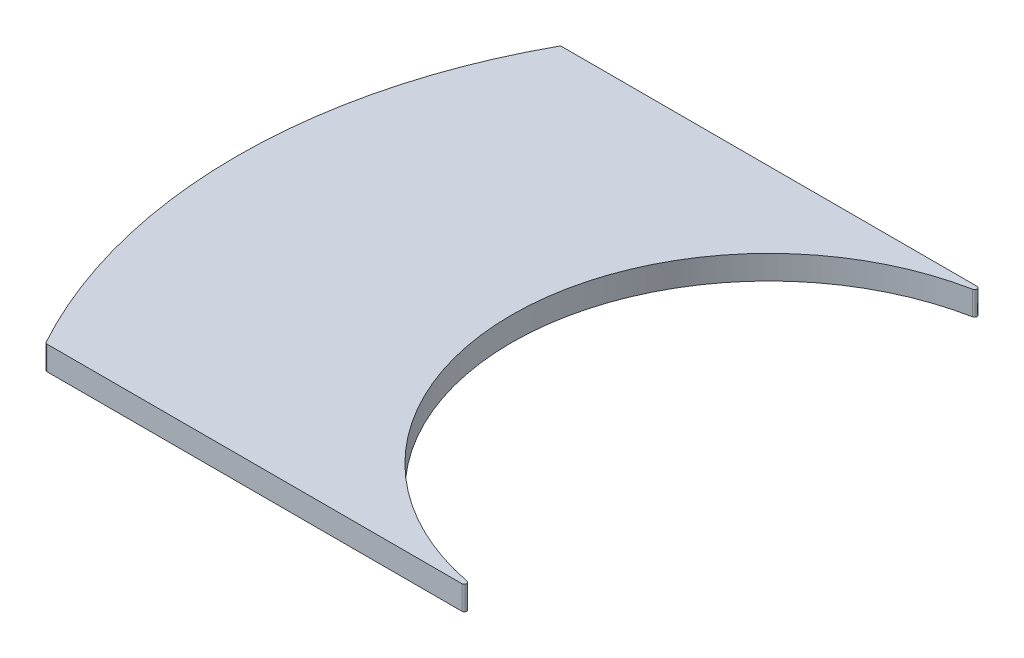
ISO-10303-21;
HEADER;
FILE_DESCRIPTION(('STEP AP214'),'2;1');
FILE_NAME('part.step','',(''),(''),'','','');
FILE_SCHEMA(('AUTOMOTIVE_DESIGN { 1 0 10303 214 1 1 1 1 }'));
ENDSEC;
DATA;
#1=APPLICATION_CONTEXT('core data for automotive mechanical design processes');
#2=APPLICATION_PROTOCOL_DEFINITION('international standard','automotive_design',2000,#1);
#3=PRODUCT_CONTEXT('',#1,'mechanical');
#4=PRODUCT('Part','Part','',(#3));
#5=PRODUCT_RELATED_PRODUCT_CATEGORY('part','',(#4));
#6=PRODUCT_DEFINITION_FORMATION('','',#4);
#7=PRODUCT_DEFINITION_CONTEXT('part definition',#1,'design');
#8=PRODUCT_DEFINITION('design','',#6,#7);
#9=PRODUCT_DEFINITION_SHAPE('','',#8);
#10=(LENGTH_UNIT() NAMED_UNIT(*) SI_UNIT(.MILLI.,.METRE.));
#11=(NAMED_UNIT(*) PLANE_ANGLE_UNIT() SI_UNIT($,.RADIAN.));
#12=(NAMED_UNIT(*) SI_UNIT($,.STERADIAN.) SOLID_ANGLE_UNIT());
#13=UNCERTAINTY_MEASURE_WITH_UNIT(LENGTH_MEASURE(1.E-05),#10,'distance_accuracy_value','');
#14=(GEOMETRIC_REPRESENTATION_CONTEXT(3) GLOBAL_UNCERTAINTY_ASSIGNED_CONTEXT((#13)) GLOBAL_UNIT_ASSIGNED_CONTEXT((#10,
#11,#12)) REPRESENTATION_CONTEXT('',''));
#15=CARTESIAN_POINT('',(0.,0.,0.));
#16=DIRECTION('',(0.,0.,1.));
#17=DIRECTION('',(1.,0.,0.));
#18=AXIS2_PLACEMENT_3D('',#15,#16,#17);
#19=CARTESIAN_POINT('',(0.,1.,-10.76));
#20=DIRECTION('',(0.,0.,1.));
#21=DIRECTION('',(1.,0.,0.));
#22=AXIS2_PLACEMENT_3D('',#19,#20,#21);
#23=PLANE('',#22);
#24=DIRECTION('',(-1.,0.,0.));
#25=VECTOR('',#24,1.);
#26=CARTESIAN_POINT('',(0.,0.,-10.76));
#27=LINE('',#26,#25);
#28=CARTESIAN_POINT('',(-2.07460839678239,0.,-10.76));
#29=VERTEX_POINT('',#28);
#30=CARTESIAN_POINT('',(-19.4104462854413,0.,-10.76));
#31=VERTEX_POINT('',#30);
#32=EDGE_CURVE('E166',#29,#31,#27,.T.);
#33=ORIENTED_EDGE('',*,*,#32,.T.);
#34=DIRECTION('',(0.,-1.,0.));
#35=VECTOR('',#34,1.);
#36=CARTESIAN_POINT('',(-19.4104462854413,1.,-10.76));
#37=LINE('',#36,#35);
#38=CARTESIAN_POINT('',(-19.4104462854413,1.,-10.76));
#39=VERTEX_POINT('',#38);
#40=EDGE_CURVE('E47',#31,#39,#37,.F.);
#41=ORIENTED_EDGE('',*,*,#40,.T.);
#42=DIRECTION('',(-1.,0.,0.));
#43=VECTOR('',#42,1.);
#44=CARTESIAN_POINT('',(0.,1.,-10.76));
#45=LINE('',#44,#43);
#46=CARTESIAN_POINT('',(-2.07460839678239,1.,-10.76));
#47=VERTEX_POINT('',#46);
#48=EDGE_CURVE('E112',#47,#39,#45,.T.);
#49=ORIENTED_EDGE('',*,*,#48,.F.);
#50=DIRECTION('',(0.,1.,0.));
#51=VECTOR('',#50,1.);
#52=CARTESIAN_POINT('',(-2.07460839678239,0.,-10.76));
#53=LINE('',#52,#51);
#54=EDGE_CURVE('E135',#47,#29,#53,.F.);
#55=ORIENTED_EDGE('',*,*,#54,.T.);
#56=EDGE_LOOP('',(#33,#41,#49,#55));
#57=FACE_BOUND('',#56,.T.);
#58=ADVANCED_FACE('F39',(#57),#23,.F.);
#59=CARTESIAN_POINT('',(0.,1.,0.));
#60=DIRECTION('',(0.,-1.,0.));
#61=DIRECTION('',(0.,0.,-1.));
#62=AXIS2_PLACEMENT_3D('',#59,#60,#61);
#63=CYLINDRICAL_SURFACE('',#62,22.245);
#64=CARTESIAN_POINT('',(0.,1.,0.));
#65=DIRECTION('',(0.,1.,0.));
#66=DIRECTION('',(0.,0.,1.));
#67=AXIS2_PLACEMENT_3D('',#64,#65,#66);
#68=CIRCLE('',#67,22.245);
#69=CARTESIAN_POINT('',(-19.4980978830274,1.,-10.7081372770377));
#70=VERTEX_POINT('',#69);
#71=CARTESIAN_POINT('',(-19.4980978830274,1.,10.7081372770377));
#72=VERTEX_POINT('',#71);
#73=EDGE_CURVE('E162',#70,#72,#68,.T.);
#74=ORIENTED_EDGE('',*,*,#73,.F.);
#75=DIRECTION('',(0.,-1.,0.));
#76=VECTOR('',#75,1.);
#77=CARTESIAN_POINT('',(-19.4980978830274,1.,-10.7081372770377));
#78=LINE('',#77,#76);
#79=CARTESIAN_POINT('',(-19.4980978830274,0.,-10.7081372770377));
#80=VERTEX_POINT('',#79);
#81=EDGE_CURVE('E154',#70,#80,#78,.T.);
#82=ORIENTED_EDGE('',*,*,#81,.T.);
#83=CARTESIAN_POINT('',(0.,0.,0.));
#84=DIRECTION('',(0.,1.,0.));
#85=DIRECTION('',(0.,0.,1.));
#86=AXIS2_PLACEMENT_3D('',#83,#84,#85);
#87=CIRCLE('',#86,22.245);
#88=CARTESIAN_POINT('',(-19.4980978830274,0.,10.7081372770377));
#89=VERTEX_POINT('',#88);
#90=EDGE_CURVE('E161',#80,#89,#87,.T.);
#91=ORIENTED_EDGE('',*,*,#90,.T.);
#92=DIRECTION('',(0.,-1.,0.));
#93=VECTOR('',#92,1.);
#94=CARTESIAN_POINT('',(-19.4980978830274,1.,10.7081372770377));
#95=LINE('',#94,#93);
#96=EDGE_CURVE('E149',#89,#72,#95,.F.);
#97=ORIENTED_EDGE('',*,*,#96,.T.);
#98=EDGE_LOOP('',(#74,#82,#91,#97));
#99=FACE_BOUND('',#98,.T.);
#100=ADVANCED_FACE('F160',(#99),#63,.T.);
#101=CARTESIAN_POINT('',(0.,1.,10.76));
#102=DIRECTION('',(0.,0.,1.));
#103=DIRECTION('',(1.,0.,0.));
#104=AXIS2_PLACEMENT_3D('',#101,#102,#103);
#105=PLANE('',#104);
#106=DIRECTION('',(-1.,0.,0.));
#107=VECTOR('',#106,1.);
#108=CARTESIAN_POINT('',(0.,1.,10.76));
#109=LINE('',#108,#107);
#110=CARTESIAN_POINT('',(-2.07460839678239,1.,10.76));
#111=VERTEX_POINT('',#110);
#112=CARTESIAN_POINT('',(-19.4104462854413,1.,10.76));
#113=VERTEX_POINT('',#112);
#114=EDGE_CURVE('E128',#111,#113,#109,.T.);
#115=ORIENTED_EDGE('',*,*,#114,.T.);
#116=DIRECTION('',(0.,1.,0.));
#117=VECTOR('',#116,1.);
#118=CARTESIAN_POINT('',(-19.4104462854413,0.,10.76));
#119=LINE('',#118,#117);
#120=CARTESIAN_POINT('',(-19.4104462854413,0.,10.76));
#121=VERTEX_POINT('',#120);
#122=EDGE_CURVE('E143',#113,#121,#119,.F.);
#123=ORIENTED_EDGE('',*,*,#122,.T.);
#124=DIRECTION('',(-1.,0.,0.));
#125=VECTOR('',#124,1.);
#126=CARTESIAN_POINT('',(0.,0.,10.76));
#127=LINE('',#126,#125);
#128=CARTESIAN_POINT('',(-2.07460839678239,0.,10.76));
#129=VERTEX_POINT('',#128);
#130=EDGE_CURVE('E113',#129,#121,#127,.T.);
#131=ORIENTED_EDGE('',*,*,#130,.F.);
#132=DIRECTION('',(0.,-1.,0.));
#133=VECTOR('',#132,1.);
#134=CARTESIAN_POINT('',(-2.07460839678239,1.,10.76));
#135=LINE('',#134,#133);
#136=EDGE_CURVE('E121',#129,#111,#135,.F.);
#137=ORIENTED_EDGE('',*,*,#136,.T.);
#138=EDGE_LOOP('',(#115,#123,#131,#137));
#139=FACE_BOUND('',#138,.T.);
#140=ADVANCED_FACE('F189',(#139),#105,.T.);
#141=CARTESIAN_POINT('',(0.,1.,0.));
#142=DIRECTION('',(0.,-1.,0.));
#143=DIRECTION('',(0.,0.,-1.));
#144=AXIS2_PLACEMENT_3D('',#141,#142,#143);
#145=CYLINDRICAL_SURFACE('',#144,10.76);
#146=CARTESIAN_POINT('',(0.,0.,0.));
#147=DIRECTION('',(0.,1.,0.));
#148=DIRECTION('',(0.,0.,1.));
#149=AXIS2_PLACEMENT_3D('',#146,#147,#148);
#150=CIRCLE('',#149,10.76);
#151=CARTESIAN_POINT('',(-2.05550518870888,0.,-10.5618416206262));
#152=VERTEX_POINT('',#151);
#153=CARTESIAN_POINT('',(-2.05550518870888,0.,10.5618416206262));
#154=VERTEX_POINT('',#153);
#155=EDGE_CURVE('E102',#152,#154,#150,.T.);
#156=ORIENTED_EDGE('',*,*,#155,.F.);
#157=DIRECTION('',(0.,-1.,0.));
#158=VECTOR('',#157,1.);
#159=CARTESIAN_POINT('',(-2.05550518870888,1.,-10.5618416206262));
#160=LINE('',#159,#158);
#161=CARTESIAN_POINT('',(-2.05550518870888,1.,-10.5618416206262));
#162=VERTEX_POINT('',#161);
#163=EDGE_CURVE('E139',#152,#162,#160,.F.);
#164=ORIENTED_EDGE('',*,*,#163,.T.);
#165=CARTESIAN_POINT('',(0.,1.,0.));
#166=DIRECTION('',(0.,1.,0.));
#167=DIRECTION('',(0.,0.,1.));
#168=AXIS2_PLACEMENT_3D('',#165,#166,#167);
#169=CIRCLE('',#168,10.76);
#170=CARTESIAN_POINT('',(-2.05550518870888,1.,10.5618416206262));
#171=VERTEX_POINT('',#170);
#172=EDGE_CURVE('E125',#162,#171,#169,.T.);
#173=ORIENTED_EDGE('',*,*,#172,.T.);
#174=DIRECTION('',(0.,-1.,0.));
#175=VECTOR('',#174,1.);
#176=CARTESIAN_POINT('',(-2.05550518870888,1.,10.5618416206262));
#177=LINE('',#176,#175);
#178=EDGE_CURVE('E120',#171,#154,#177,.T.);
#179=ORIENTED_EDGE('',*,*,#178,.T.);
#180=EDGE_LOOP('',(#156,#164,#173,#179));
#181=FACE_BOUND('',#180,.T.);
#182=ADVANCED_FACE('F123',(#181),#145,.F.);
#183=CARTESIAN_POINT('',(0.,1.,0.));
#184=DIRECTION('',(0.,1.,0.));
#185=DIRECTION('',(0.,0.,1.));
#186=AXIS2_PLACEMENT_3D('',#183,#184,#185);
#187=PLANE('',#186);
#188=ORIENTED_EDGE('',*,*,#48,.T.);
#189=CARTESIAN_POINT('',(-19.4104462854413,1.,-10.66));
#190=DIRECTION('',(0.,1.,0.));
#191=DIRECTION('',(0.,0.,1.));
#192=AXIS2_PLACEMENT_3D('',#189,#190,#191);
#193=CIRCLE('',#192,0.1);
#194=EDGE_CURVE('E11',#39,#70,#193,.T.);
#195=ORIENTED_EDGE('',*,*,#194,.T.);
#196=ORIENTED_EDGE('',*,*,#73,.T.);
#197=CARTESIAN_POINT('',(-19.4104462854413,1.,10.66));
#198=DIRECTION('',(0.,1.,0.));
#199=DIRECTION('',(0.,0.,1.));
#200=AXIS2_PLACEMENT_3D('',#197,#198,#199);
#201=CIRCLE('',#200,0.1);
#202=EDGE_CURVE('E152',#72,#113,#201,.T.);
#203=ORIENTED_EDGE('',*,*,#202,.T.);
#204=ORIENTED_EDGE('',*,*,#114,.F.);
#205=CARTESIAN_POINT('',(-2.07460839678239,1.,10.66));
#206=DIRECTION('',(0.,1.,0.));
#207=DIRECTION('',(0.,0.,1.));
#208=AXIS2_PLACEMENT_3D('',#205,#206,#207);
#209=CIRCLE('',#208,0.1);
#210=EDGE_CURVE('E133',#111,#171,#209,.T.);
#211=ORIENTED_EDGE('',*,*,#210,.T.);
#212=ORIENTED_EDGE('',*,*,#172,.F.);
#213=CARTESIAN_POINT('',(-2.07460839678239,1.,-10.66));
#214=DIRECTION('',(0.,1.,0.));
#215=DIRECTION('',(0.,0.,1.));
#216=AXIS2_PLACEMENT_3D('',#213,#214,#215);
#217=CIRCLE('',#216,0.1);
#218=EDGE_CURVE('E141',#162,#47,#217,.T.);
#219=ORIENTED_EDGE('',*,*,#218,.T.);
#220=EDGE_LOOP('',(#188,#195,#196,#203,#204,#211,#212,#219));
#221=FACE_BOUND('',#220,.T.);
#222=ADVANCED_FACE('F174',(#221),#187,.T.);
#223=CARTESIAN_POINT('',(0.,0.,0.));
#224=DIRECTION('',(0.,1.,0.));
#225=DIRECTION('',(0.,0.,1.));
#226=AXIS2_PLACEMENT_3D('',#223,#224,#225);
#227=PLANE('',#226);
#228=ORIENTED_EDGE('',*,*,#90,.F.);
#229=CARTESIAN_POINT('',(-19.4104462854413,0.,-10.66));
#230=DIRECTION('',(0.,1.,0.));
#231=DIRECTION('',(0.,0.,1.));
#232=AXIS2_PLACEMENT_3D('',#229,#230,#231);
#233=CIRCLE('',#232,0.1);
#234=EDGE_CURVE('E61',#80,#31,#233,.F.);
#235=ORIENTED_EDGE('',*,*,#234,.T.);
#236=ORIENTED_EDGE('',*,*,#32,.F.);
#237=CARTESIAN_POINT('',(-2.07460839678239,0.,-10.66));
#238=DIRECTION('',(0.,1.,0.));
#239=DIRECTION('',(0.,0.,1.));
#240=AXIS2_PLACEMENT_3D('',#237,#238,#239);
#241=CIRCLE('',#240,0.1);
#242=EDGE_CURVE('E108',#29,#152,#241,.F.);
#243=ORIENTED_EDGE('',*,*,#242,.T.);
#244=ORIENTED_EDGE('',*,*,#155,.T.);
#245=CARTESIAN_POINT('',(-2.07460839678239,0.,10.66));
#246=DIRECTION('',(0.,1.,0.));
#247=DIRECTION('',(0.,0.,1.));
#248=AXIS2_PLACEMENT_3D('',#245,#246,#247);
#249=CIRCLE('',#248,0.1);
#250=EDGE_CURVE('E106',#154,#129,#249,.F.);
#251=ORIENTED_EDGE('',*,*,#250,.T.);
#252=ORIENTED_EDGE('',*,*,#130,.T.);
#253=CARTESIAN_POINT('',(-19.4104462854413,0.,10.66));
#254=DIRECTION('',(0.,1.,0.));
#255=DIRECTION('',(0.,0.,1.));
#256=AXIS2_PLACEMENT_3D('',#253,#254,#255);
#257=CIRCLE('',#256,0.1);
#258=EDGE_CURVE('E146',#121,#89,#257,.F.);
#259=ORIENTED_EDGE('',*,*,#258,.T.);
#260=EDGE_LOOP('',(#228,#235,#236,#243,#244,#251,#252,#259));
#261=FACE_BOUND('',#260,.T.);
#262=ADVANCED_FACE('F104',(#261),#227,.F.);
#263=CARTESIAN_POINT('',(-2.07460839678239,1.,10.66));
#264=DIRECTION('',(0.,-1.,0.));
#265=DIRECTION('',(0.,0.,-1.));
#266=AXIS2_PLACEMENT_3D('',#263,#264,#265);
#267=CYLINDRICAL_SURFACE('',#266,0.1);
#268=ORIENTED_EDGE('',*,*,#210,.F.);
#269=ORIENTED_EDGE('',*,*,#136,.F.);
#270=ORIENTED_EDGE('',*,*,#250,.F.);
#271=ORIENTED_EDGE('',*,*,#178,.F.);
#272=EDGE_LOOP('',(#268,#269,#270,#271));
#273=FACE_BOUND('',#272,.T.);
#274=ADVANCED_FACE('F119',(#273),#267,.T.);
#275=CARTESIAN_POINT('',(-2.07460839678239,1.,-10.66));
#276=DIRECTION('',(0.,-1.,0.));
#277=DIRECTION('',(0.,0.,-1.));
#278=AXIS2_PLACEMENT_3D('',#275,#276,#277);
#279=CYLINDRICAL_SURFACE('',#278,0.1);
#280=ORIENTED_EDGE('',*,*,#218,.F.);
#281=ORIENTED_EDGE('',*,*,#163,.F.);
#282=ORIENTED_EDGE('',*,*,#242,.F.);
#283=ORIENTED_EDGE('',*,*,#54,.F.);
#284=EDGE_LOOP('',(#280,#281,#282,#283));
#285=FACE_BOUND('',#284,.T.);
#286=ADVANCED_FACE('F182',(#285),#279,.T.);
#287=CARTESIAN_POINT('',(-19.4104462854413,1.,10.66));
#288=DIRECTION('',(0.,-1.,0.));
#289=DIRECTION('',(0.,0.,-1.));
#290=AXIS2_PLACEMENT_3D('',#287,#288,#289);
#291=CYLINDRICAL_SURFACE('',#290,0.1);
#292=ORIENTED_EDGE('',*,*,#202,.F.);
#293=ORIENTED_EDGE('',*,*,#96,.F.);
#294=ORIENTED_EDGE('',*,*,#258,.F.);
#295=ORIENTED_EDGE('',*,*,#122,.F.);
#296=EDGE_LOOP('',(#292,#293,#294,#295));
#297=FACE_BOUND('',#296,.T.);
#298=ADVANCED_FACE('F178',(#297),#291,.T.);
#299=CARTESIAN_POINT('',(-19.4104462854413,1.,-10.66));
#300=DIRECTION('',(0.,-1.,0.));
#301=DIRECTION('',(0.,0.,-1.));
#302=AXIS2_PLACEMENT_3D('',#299,#300,#301);
#303=CYLINDRICAL_SURFACE('',#302,0.1);
#304=ORIENTED_EDGE('',*,*,#194,.F.);
#305=ORIENTED_EDGE('',*,*,#40,.F.);
#306=ORIENTED_EDGE('',*,*,#234,.F.);
#307=ORIENTED_EDGE('',*,*,#81,.F.);
#308=EDGE_LOOP('',(#304,#305,#306,#307));
#309=FACE_BOUND('',#308,.T.);
#310=ADVANCED_FACE('F41',(#309),#303,.T.);
#311=CLOSED_SHELL('',(#58,#100,#140,#182,#222,#262,#274,#286,#298,#310));
#312=MANIFOLD_SOLID_BREP('B2',#311);
#313=ADVANCED_BREP_SHAPE_REPRESENTATION('',(#18,#312),#14);
#314=SHAPE_DEFINITION_REPRESENTATION(#9,#313);
ENDSEC;
END-ISO-10303-21;
